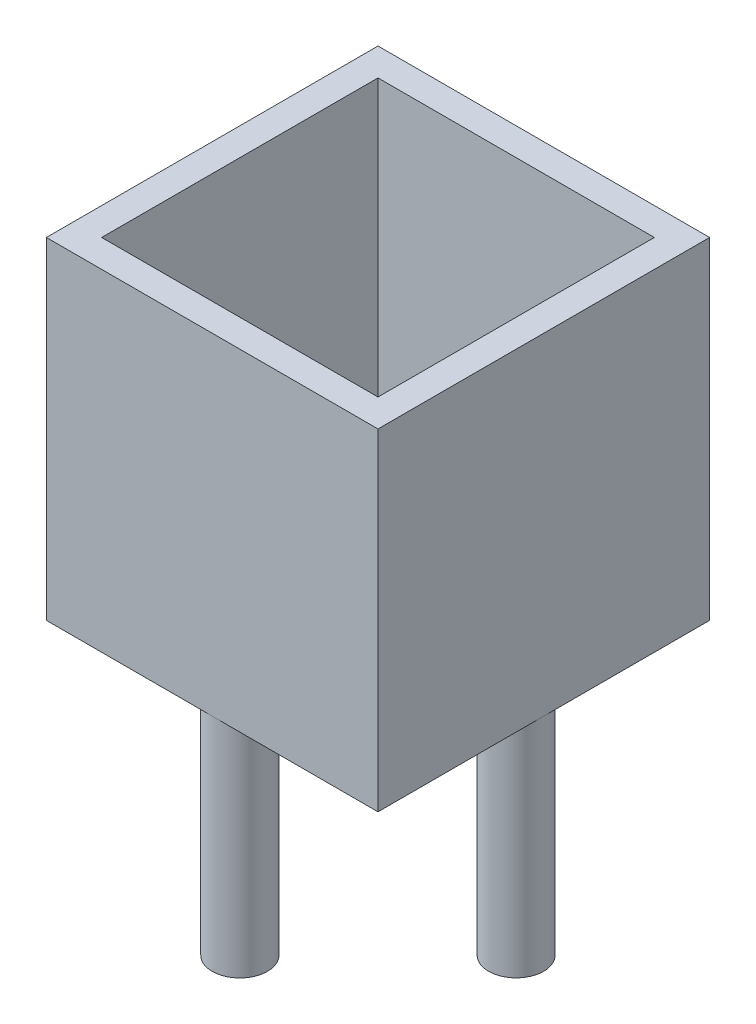
ISO-10303-21;
HEADER;
FILE_DESCRIPTION(('STEP AP214'),'2;1');
FILE_NAME('part.step','',(''),(''),'','','');
FILE_SCHEMA(('AUTOMOTIVE_DESIGN { 1 0 10303 214 1 1 1 1 }'));
ENDSEC;
DATA;
#1=APPLICATION_CONTEXT('core data for automotive mechanical design processes');
#2=APPLICATION_PROTOCOL_DEFINITION('international standard','automotive_design',2000,#1);
#3=PRODUCT_CONTEXT('',#1,'mechanical');
#4=PRODUCT('Part','Part','',(#3));
#5=PRODUCT_RELATED_PRODUCT_CATEGORY('part','',(#4));
#6=PRODUCT_DEFINITION_FORMATION('','',#4);
#7=PRODUCT_DEFINITION_CONTEXT('part definition',#1,'design');
#8=PRODUCT_DEFINITION('design','',#6,#7);
#9=PRODUCT_DEFINITION_SHAPE('','',#8);
#10=(LENGTH_UNIT() NAMED_UNIT(*) SI_UNIT(.MILLI.,.METRE.));
#11=(NAMED_UNIT(*) PLANE_ANGLE_UNIT() SI_UNIT($,.RADIAN.));
#12=(NAMED_UNIT(*) SI_UNIT($,.STERADIAN.) SOLID_ANGLE_UNIT());
#13=UNCERTAINTY_MEASURE_WITH_UNIT(LENGTH_MEASURE(1.E-05),#10,'distance_accuracy_value','');
#14=(GEOMETRIC_REPRESENTATION_CONTEXT(3) GLOBAL_UNCERTAINTY_ASSIGNED_CONTEXT((#13)) GLOBAL_UNIT_ASSIGNED_CONTEXT((#10,
#11,#12)) REPRESENTATION_CONTEXT('',''));
#15=CARTESIAN_POINT('',(0.,0.,0.));
#16=DIRECTION('',(0.,0.,1.));
#17=DIRECTION('',(1.,0.,0.));
#18=AXIS2_PLACEMENT_3D('',#15,#16,#17);
#19=CARTESIAN_POINT('',(-50.,-80.,0.));
#20=DIRECTION('',(0.,1.,0.));
#21=DIRECTION('',(0.,0.,1.));
#22=AXIS2_PLACEMENT_3D('',#19,#20,#21);
#23=CYLINDRICAL_SURFACE('',#22,10.);
#24=CARTESIAN_POINT('',(-50.,0.,0.));
#25=DIRECTION('',(0.,-1.,0.));
#26=DIRECTION('',(0.,0.,-1.));
#27=AXIS2_PLACEMENT_3D('',#24,#25,#26);
#28=CIRCLE('',#27,10.);
#29=CARTESIAN_POINT('',(-50.,0.,-10.));
#30=VERTEX_POINT('',#29);
#31=EDGE_CURVE('E42',#30,#30,#28,.T.);
#32=ORIENTED_EDGE('',*,*,#31,.T.);
#33=EDGE_LOOP('',(#32));
#34=FACE_BOUND('',#33,.T.);
#35=CARTESIAN_POINT('',(-50.,-80.,0.));
#36=DIRECTION('',(0.,-1.,0.));
#37=DIRECTION('',(0.,0.,-1.));
#38=AXIS2_PLACEMENT_3D('',#35,#36,#37);
#39=CIRCLE('',#38,10.);
#40=CARTESIAN_POINT('',(-50.,-80.,-10.));
#41=VERTEX_POINT('',#40);
#42=EDGE_CURVE('E11',#41,#41,#39,.T.);
#43=ORIENTED_EDGE('',*,*,#42,.F.);
#44=EDGE_LOOP('',(#43));
#45=FACE_BOUND('',#44,.T.);
#46=ADVANCED_FACE('F39',(#34,#45),#23,.T.);
#47=CARTESIAN_POINT('',(-50.,-80.,0.));
#48=DIRECTION('',(0.,-1.,0.));
#49=DIRECTION('',(0.,0.,-1.));
#50=AXIS2_PLACEMENT_3D('',#47,#48,#49);
#51=PLANE('',#50);
#52=ORIENTED_EDGE('',*,*,#42,.T.);
#53=EDGE_LOOP('',(#52));
#54=FACE_BOUND('',#53,.T.);
#55=ADVANCED_FACE('F55',(#54),#51,.T.);
#56=CARTESIAN_POINT('',(-50.,0.,0.));
#57=DIRECTION('',(0.,-1.,0.));
#58=DIRECTION('',(0.,0.,-1.));
#59=AXIS2_PLACEMENT_3D('',#56,#57,#58);
#60=PLANE('',#59);
#61=ORIENTED_EDGE('',*,*,#31,.F.);
#62=EDGE_LOOP('',(#61));
#63=FACE_BOUND('',#62,.T.);
#64=ADVANCED_FACE('F53',(#63),#60,.F.);
#65=CLOSED_SHELL('',(#46,#55,#64));
#66=MANIFOLD_SOLID_BREP('B2',#65);
#67=CARTESIAN_POINT('',(0.,-80.,-50.));
#68=DIRECTION('',(0.,1.,0.));
#69=DIRECTION('',(0.,0.,1.));
#70=AXIS2_PLACEMENT_3D('',#67,#68,#69);
#71=CYLINDRICAL_SURFACE('',#70,10.);
#72=CARTESIAN_POINT('',(0.,0.,-50.));
#73=DIRECTION('',(0.,-1.,0.));
#74=DIRECTION('',(0.,0.,-1.));
#75=AXIS2_PLACEMENT_3D('',#72,#73,#74);
#76=CIRCLE('',#75,10.);
#77=CARTESIAN_POINT('',(0.,0.,-60.));
#78=VERTEX_POINT('',#77);
#79=EDGE_CURVE('E86',#78,#78,#76,.T.);
#80=ORIENTED_EDGE('',*,*,#79,.T.);
#81=EDGE_LOOP('',(#80));
#82=FACE_BOUND('',#81,.T.);
#83=CARTESIAN_POINT('',(0.,-80.,-50.));
#84=DIRECTION('',(0.,-1.,0.));
#85=DIRECTION('',(0.,0.,-1.));
#86=AXIS2_PLACEMENT_3D('',#83,#84,#85);
#87=CIRCLE('',#86,10.);
#88=CARTESIAN_POINT('',(0.,-80.,-60.));
#89=VERTEX_POINT('',#88);
#90=EDGE_CURVE('E38',#89,#89,#87,.T.);
#91=ORIENTED_EDGE('',*,*,#90,.F.);
#92=EDGE_LOOP('',(#91));
#93=FACE_BOUND('',#92,.T.);
#94=ADVANCED_FACE('F83',(#82,#93),#71,.T.);
#95=CARTESIAN_POINT('',(0.,-80.,-50.));
#96=DIRECTION('',(0.,-1.,0.));
#97=DIRECTION('',(0.,0.,-1.));
#98=AXIS2_PLACEMENT_3D('',#95,#96,#97);
#99=PLANE('',#98);
#100=ORIENTED_EDGE('',*,*,#90,.T.);
#101=EDGE_LOOP('',(#100));
#102=FACE_BOUND('',#101,.T.);
#103=ADVANCED_FACE('F99',(#102),#99,.T.);
#104=CARTESIAN_POINT('',(0.,0.,-50.));
#105=DIRECTION('',(0.,-1.,0.));
#106=DIRECTION('',(0.,0.,-1.));
#107=AXIS2_PLACEMENT_3D('',#104,#105,#106);
#108=PLANE('',#107);
#109=ORIENTED_EDGE('',*,*,#79,.F.);
#110=EDGE_LOOP('',(#109));
#111=FACE_BOUND('',#110,.T.);
#112=ADVANCED_FACE('F97',(#111),#108,.F.);
#113=CLOSED_SHELL('',(#94,#103,#112));
#114=MANIFOLD_SOLID_BREP('B6',#113);
#115=CARTESIAN_POINT('',(49.9764103791812,-80.,0.));
#116=DIRECTION('',(0.,1.,0.));
#117=DIRECTION('',(0.,0.,1.));
#118=AXIS2_PLACEMENT_3D('',#115,#116,#117);
#119=CYLINDRICAL_SURFACE('',#118,9.97641037918125);
#120=CARTESIAN_POINT('',(49.9764103791812,0.,0.));
#121=DIRECTION('',(0.,-1.,0.));
#122=DIRECTION('',(0.,0.,-1.));
#123=AXIS2_PLACEMENT_3D('',#120,#121,#122);
#124=CIRCLE('',#123,9.97641037918125);
#125=CARTESIAN_POINT('',(49.9764103791812,0.,-9.97641037918125));
#126=VERTEX_POINT('',#125);
#127=EDGE_CURVE('E130',#126,#126,#124,.T.);
#128=ORIENTED_EDGE('',*,*,#127,.T.);
#129=EDGE_LOOP('',(#128));
#130=FACE_BOUND('',#129,.T.);
#131=CARTESIAN_POINT('',(49.9764103791812,-80.,0.));
#132=DIRECTION('',(0.,-1.,0.));
#133=DIRECTION('',(0.,0.,-1.));
#134=AXIS2_PLACEMENT_3D('',#131,#132,#133);
#135=CIRCLE('',#134,9.97641037918125);
#136=CARTESIAN_POINT('',(49.9764103791812,-80.,-9.97641037918125));
#137=VERTEX_POINT('',#136);
#138=EDGE_CURVE('E82',#137,#137,#135,.T.);
#139=ORIENTED_EDGE('',*,*,#138,.F.);
#140=EDGE_LOOP('',(#139));
#141=FACE_BOUND('',#140,.T.);
#142=ADVANCED_FACE('F127',(#130,#141),#119,.T.);
#143=CARTESIAN_POINT('',(49.9764103791812,-80.,0.));
#144=DIRECTION('',(0.,-1.,0.));
#145=DIRECTION('',(0.,0.,-1.));
#146=AXIS2_PLACEMENT_3D('',#143,#144,#145);
#147=PLANE('',#146);
#148=ORIENTED_EDGE('',*,*,#138,.T.);
#149=EDGE_LOOP('',(#148));
#150=FACE_BOUND('',#149,.T.);
#151=ADVANCED_FACE('F143',(#150),#147,.T.);
#152=CARTESIAN_POINT('',(49.9764103791812,0.,0.));
#153=DIRECTION('',(0.,-1.,0.));
#154=DIRECTION('',(0.,0.,-1.));
#155=AXIS2_PLACEMENT_3D('',#152,#153,#154);
#156=PLANE('',#155);
#157=ORIENTED_EDGE('',*,*,#127,.F.);
#158=EDGE_LOOP('',(#157));
#159=FACE_BOUND('',#158,.T.);
#160=ADVANCED_FACE('F141',(#159),#156,.F.);
#161=CLOSED_SHELL('',(#142,#151,#160));
#162=MANIFOLD_SOLID_BREP('B33',#161);
#163=CARTESIAN_POINT('',(0.,-80.,50.));
#164=DIRECTION('',(0.,1.,0.));
#165=DIRECTION('',(0.,0.,1.));
#166=AXIS2_PLACEMENT_3D('',#163,#164,#165);
#167=CYLINDRICAL_SURFACE('',#166,10.);
#168=CARTESIAN_POINT('',(0.,0.,50.));
#169=DIRECTION('',(0.,-1.,0.));
#170=DIRECTION('',(0.,0.,-1.));
#171=AXIS2_PLACEMENT_3D('',#168,#169,#170);
#172=CIRCLE('',#171,10.);
#173=CARTESIAN_POINT('',(0.,0.,40.));
#174=VERTEX_POINT('',#173);
#175=EDGE_CURVE('E175',#174,#174,#172,.T.);
#176=ORIENTED_EDGE('',*,*,#175,.T.);
#177=EDGE_LOOP('',(#176));
#178=FACE_BOUND('',#177,.T.);
#179=CARTESIAN_POINT('',(0.,-80.,50.));
#180=DIRECTION('',(0.,-1.,0.));
#181=DIRECTION('',(0.,0.,-1.));
#182=AXIS2_PLACEMENT_3D('',#179,#180,#181);
#183=CIRCLE('',#182,10.);
#184=CARTESIAN_POINT('',(0.,-80.,40.));
#185=VERTEX_POINT('',#184);
#186=EDGE_CURVE('E126',#185,#185,#183,.T.);
#187=ORIENTED_EDGE('',*,*,#186,.F.);
#188=EDGE_LOOP('',(#187));
#189=FACE_BOUND('',#188,.T.);
#190=ADVANCED_FACE('F172',(#178,#189),#167,.T.);
#191=CARTESIAN_POINT('',(0.,-80.,50.));
#192=DIRECTION('',(0.,-1.,0.));
#193=DIRECTION('',(0.,0.,-1.));
#194=AXIS2_PLACEMENT_3D('',#191,#192,#193);
#195=PLANE('',#194);
#196=ORIENTED_EDGE('',*,*,#186,.T.);
#197=EDGE_LOOP('',(#196));
#198=FACE_BOUND('',#197,.T.);
#199=ADVANCED_FACE('F188',(#198),#195,.T.);
#200=CARTESIAN_POINT('',(0.,0.,50.));
#201=DIRECTION('',(0.,-1.,0.));
#202=DIRECTION('',(0.,0.,-1.));
#203=AXIS2_PLACEMENT_3D('',#200,#201,#202);
#204=PLANE('',#203);
#205=ORIENTED_EDGE('',*,*,#175,.F.);
#206=EDGE_LOOP('',(#205));
#207=FACE_BOUND('',#206,.T.);
#208=ADVANCED_FACE('F186',(#207),#204,.F.);
#209=CLOSED_SHELL('',(#190,#199,#208));
#210=MANIFOLD_SOLID_BREP('B77',#209);
#211=CARTESIAN_POINT('',(0.,0.,0.));
#212=DIRECTION('',(0.,-1.,0.));
#213=DIRECTION('',(0.,0.,-1.));
#214=AXIS2_PLACEMENT_3D('',#211,#212,#213);
#215=PLANE('',#214);
#216=DIRECTION('',(0.,0.,-1.));
#217=VECTOR('',#216,1.);
#218=CARTESIAN_POINT('',(60.,0.,60.));
#219=LINE('',#218,#217);
#220=CARTESIAN_POINT('',(60.,0.,60.));
#221=VERTEX_POINT('',#220);
#222=CARTESIAN_POINT('',(60.,0.,-60.));
#223=VERTEX_POINT('',#222);
#224=EDGE_CURVE('E306',#221,#223,#219,.T.);
#225=ORIENTED_EDGE('',*,*,#224,.F.);
#226=DIRECTION('',(1.,0.,0.));
#227=VECTOR('',#226,1.);
#228=CARTESIAN_POINT('',(-60.,0.,60.));
#229=LINE('',#228,#227);
#230=CARTESIAN_POINT('',(-60.,0.,60.));
#231=VERTEX_POINT('',#230);
#232=EDGE_CURVE('E311',#231,#221,#229,.T.);
#233=ORIENTED_EDGE('',*,*,#232,.F.);
#234=DIRECTION('',(0.,0.,1.));
#235=VECTOR('',#234,1.);
#236=CARTESIAN_POINT('',(-60.,0.,60.));
#237=LINE('',#236,#235);
#238=CARTESIAN_POINT('',(-60.,0.,-60.));
#239=VERTEX_POINT('',#238);
#240=EDGE_CURVE('E323',#239,#231,#237,.T.);
#241=ORIENTED_EDGE('',*,*,#240,.F.);
#242=DIRECTION('',(-1.,0.,0.));
#243=VECTOR('',#242,1.);
#244=CARTESIAN_POINT('',(-60.,0.,-60.));
#245=LINE('',#244,#243);
#246=EDGE_CURVE('E320',#223,#239,#245,.T.);
#247=ORIENTED_EDGE('',*,*,#246,.F.);
#248=EDGE_LOOP('',(#225,#233,#241,#247));
#249=FACE_BOUND('',#248,.T.);
#250=ADVANCED_FACE('F208',(#249),#215,.T.);
#251=CARTESIAN_POINT('',(0.,120.,0.));
#252=DIRECTION('',(0.,-1.,0.));
#253=DIRECTION('',(0.,0.,-1.));
#254=AXIS2_PLACEMENT_3D('',#251,#252,#253);
#255=PLANE('',#254);
#256=DIRECTION('',(0.,0.,-1.));
#257=VECTOR('',#256,1.);
#258=CARTESIAN_POINT('',(60.,120.,60.));
#259=LINE('',#258,#257);
#260=CARTESIAN_POINT('',(60.,120.,60.));
#261=VERTEX_POINT('',#260);
#262=CARTESIAN_POINT('',(60.,120.,-60.));
#263=VERTEX_POINT('',#262);
#264=EDGE_CURVE('E307',#261,#263,#259,.T.);
#265=ORIENTED_EDGE('',*,*,#264,.T.);
#266=DIRECTION('',(-1.,0.,0.));
#267=VECTOR('',#266,1.);
#268=CARTESIAN_POINT('',(-60.,120.,-60.));
#269=LINE('',#268,#267);
#270=CARTESIAN_POINT('',(-60.,120.,-60.));
#271=VERTEX_POINT('',#270);
#272=EDGE_CURVE('E310',#263,#271,#269,.T.);
#273=ORIENTED_EDGE('',*,*,#272,.T.);
#274=DIRECTION('',(0.,0.,1.));
#275=VECTOR('',#274,1.);
#276=CARTESIAN_POINT('',(-60.,120.,60.));
#277=LINE('',#276,#275);
#278=CARTESIAN_POINT('',(-60.,120.,60.));
#279=VERTEX_POINT('',#278);
#280=EDGE_CURVE('E313',#271,#279,#277,.T.);
#281=ORIENTED_EDGE('',*,*,#280,.T.);
#282=DIRECTION('',(1.,0.,0.));
#283=VECTOR('',#282,1.);
#284=CARTESIAN_POINT('',(-60.,120.,60.));
#285=LINE('',#284,#283);
#286=EDGE_CURVE('E315',#279,#261,#285,.T.);
#287=ORIENTED_EDGE('',*,*,#286,.T.);
#288=EDGE_LOOP('',(#265,#273,#281,#287));
#289=FACE_BOUND('',#288,.T.);
#290=DIRECTION('',(0.,0.,-1.));
#291=VECTOR('',#290,1.);
#292=CARTESIAN_POINT('',(50.,120.,50.));
#293=LINE('',#292,#291);
#294=CARTESIAN_POINT('',(50.,120.,50.));
#295=VERTEX_POINT('',#294);
#296=CARTESIAN_POINT('',(50.,120.,-50.));
#297=VERTEX_POINT('',#296);
#298=EDGE_CURVE('E289',#295,#297,#293,.T.);
#299=ORIENTED_EDGE('',*,*,#298,.F.);
#300=DIRECTION('',(1.,0.,0.));
#301=VECTOR('',#300,1.);
#302=CARTESIAN_POINT('',(-50.,120.,50.));
#303=LINE('',#302,#301);
#304=CARTESIAN_POINT('',(-50.,120.,50.));
#305=VERTEX_POINT('',#304);
#306=EDGE_CURVE('E279',#305,#295,#303,.T.);
#307=ORIENTED_EDGE('',*,*,#306,.F.);
#308=DIRECTION('',(0.,0.,1.));
#309=VECTOR('',#308,1.);
#310=CARTESIAN_POINT('',(-50.,120.,50.));
#311=LINE('',#310,#309);
#312=CARTESIAN_POINT('',(-50.,120.,-50.));
#313=VERTEX_POINT('',#312);
#314=EDGE_CURVE('E298',#313,#305,#311,.T.);
#315=ORIENTED_EDGE('',*,*,#314,.F.);
#316=DIRECTION('',(-1.,0.,0.));
#317=VECTOR('',#316,1.);
#318=CARTESIAN_POINT('',(-50.,120.,-50.));
#319=LINE('',#318,#317);
#320=EDGE_CURVE('E296',#297,#313,#319,.T.);
#321=ORIENTED_EDGE('',*,*,#320,.F.);
#322=EDGE_LOOP('',(#299,#307,#315,#321));
#323=FACE_BOUND('',#322,.T.);
#324=ADVANCED_FACE('F352',(#289,#323),#255,.F.);
#325=CARTESIAN_POINT('',(60.,120.,60.));
#326=DIRECTION('',(-1.,0.,0.));
#327=DIRECTION('',(0.,0.,1.));
#328=AXIS2_PLACEMENT_3D('',#325,#326,#327);
#329=PLANE('',#328);
#330=DIRECTION('',(0.,-1.,0.));
#331=VECTOR('',#330,1.);
#332=CARTESIAN_POINT('',(60.,120.,60.));
#333=LINE('',#332,#331);
#334=EDGE_CURVE('E317',#261,#221,#333,.T.);
#335=ORIENTED_EDGE('',*,*,#334,.T.);
#336=ORIENTED_EDGE('',*,*,#224,.T.);
#337=DIRECTION('',(0.,-1.,0.));
#338=VECTOR('',#337,1.);
#339=CARTESIAN_POINT('',(60.,120.,-60.));
#340=LINE('',#339,#338);
#341=EDGE_CURVE('E216',#263,#223,#340,.T.);
#342=ORIENTED_EDGE('',*,*,#341,.F.);
#343=ORIENTED_EDGE('',*,*,#264,.F.);
#344=EDGE_LOOP('',(#335,#336,#342,#343));
#345=FACE_BOUND('',#344,.T.);
#346=ADVANCED_FACE('F210',(#345),#329,.F.);
#347=CARTESIAN_POINT('',(-60.,120.,-60.));
#348=DIRECTION('',(0.,0.,1.));
#349=DIRECTION('',(1.,0.,0.));
#350=AXIS2_PLACEMENT_3D('',#347,#348,#349);
#351=PLANE('',#350);
#352=ORIENTED_EDGE('',*,*,#341,.T.);
#353=ORIENTED_EDGE('',*,*,#246,.T.);
#354=DIRECTION('',(0.,-1.,0.));
#355=VECTOR('',#354,1.);
#356=CARTESIAN_POINT('',(-60.,120.,-60.));
#357=LINE('',#356,#355);
#358=EDGE_CURVE('E331',#271,#239,#357,.T.);
#359=ORIENTED_EDGE('',*,*,#358,.F.);
#360=ORIENTED_EDGE('',*,*,#272,.F.);
#361=EDGE_LOOP('',(#352,#353,#359,#360));
#362=FACE_BOUND('',#361,.T.);
#363=ADVANCED_FACE('F335',(#362),#351,.F.);
#364=CARTESIAN_POINT('',(-60.,120.,60.));
#365=DIRECTION('',(1.,0.,0.));
#366=DIRECTION('',(0.,0.,-1.));
#367=AXIS2_PLACEMENT_3D('',#364,#365,#366);
#368=PLANE('',#367);
#369=ORIENTED_EDGE('',*,*,#358,.T.);
#370=ORIENTED_EDGE('',*,*,#240,.T.);
#371=DIRECTION('',(0.,-1.,0.));
#372=VECTOR('',#371,1.);
#373=CARTESIAN_POINT('',(-60.,120.,60.));
#374=LINE('',#373,#372);
#375=EDGE_CURVE('E329',#279,#231,#374,.T.);
#376=ORIENTED_EDGE('',*,*,#375,.F.);
#377=ORIENTED_EDGE('',*,*,#280,.F.);
#378=EDGE_LOOP('',(#369,#370,#376,#377));
#379=FACE_BOUND('',#378,.T.);
#380=ADVANCED_FACE('F350',(#379),#368,.F.);
#381=CARTESIAN_POINT('',(-60.,120.,60.));
#382=DIRECTION('',(0.,0.,-1.));
#383=DIRECTION('',(-1.,0.,0.));
#384=AXIS2_PLACEMENT_3D('',#381,#382,#383);
#385=PLANE('',#384);
#386=ORIENTED_EDGE('',*,*,#375,.T.);
#387=ORIENTED_EDGE('',*,*,#232,.T.);
#388=ORIENTED_EDGE('',*,*,#334,.F.);
#389=ORIENTED_EDGE('',*,*,#286,.F.);
#390=EDGE_LOOP('',(#386,#387,#388,#389));
#391=FACE_BOUND('',#390,.T.);
#392=ADVANCED_FACE('F346',(#391),#385,.F.);
#393=CARTESIAN_POINT('',(50.,120.,50.));
#394=DIRECTION('',(-1.,0.,0.));
#395=DIRECTION('',(0.,0.,1.));
#396=AXIS2_PLACEMENT_3D('',#393,#394,#395);
#397=PLANE('',#396);
#398=DIRECTION('',(0.,0.,-1.));
#399=VECTOR('',#398,1.);
#400=CARTESIAN_POINT('',(50.,9.99999999999999,50.));
#401=LINE('',#400,#399);
#402=CARTESIAN_POINT('',(50.,9.99999999999999,50.));
#403=VERTEX_POINT('',#402);
#404=CARTESIAN_POINT('',(50.,9.99999999999999,-50.));
#405=VERTEX_POINT('',#404);
#406=EDGE_CURVE('E285',#403,#405,#401,.T.);
#407=ORIENTED_EDGE('',*,*,#406,.F.);
#408=DIRECTION('',(0.,-1.,0.));
#409=VECTOR('',#408,1.);
#410=CARTESIAN_POINT('',(50.,120.,50.));
#411=LINE('',#410,#409);
#412=EDGE_CURVE('E275',#295,#403,#411,.T.);
#413=ORIENTED_EDGE('',*,*,#412,.F.);
#414=ORIENTED_EDGE('',*,*,#298,.T.);
#415=DIRECTION('',(0.,-1.,0.));
#416=VECTOR('',#415,1.);
#417=CARTESIAN_POINT('',(50.,120.,-50.));
#418=LINE('',#417,#416);
#419=EDGE_CURVE('E287',#297,#405,#418,.T.);
#420=ORIENTED_EDGE('',*,*,#419,.T.);
#421=EDGE_LOOP('',(#407,#413,#414,#420));
#422=FACE_BOUND('',#421,.T.);
#423=ADVANCED_FACE('F286',(#422),#397,.T.);
#424=CARTESIAN_POINT('',(-50.,120.,-50.));
#425=DIRECTION('',(0.,0.,1.));
#426=DIRECTION('',(1.,0.,0.));
#427=AXIS2_PLACEMENT_3D('',#424,#425,#426);
#428=PLANE('',#427);
#429=DIRECTION('',(-1.,0.,0.));
#430=VECTOR('',#429,1.);
#431=CARTESIAN_POINT('',(-50.,9.99999999999999,-50.));
#432=LINE('',#431,#430);
#433=CARTESIAN_POINT('',(-50.,9.99999999999999,-50.));
#434=VERTEX_POINT('',#433);
#435=EDGE_CURVE('E223',#405,#434,#432,.T.);
#436=ORIENTED_EDGE('',*,*,#435,.F.);
#437=ORIENTED_EDGE('',*,*,#419,.F.);
#438=ORIENTED_EDGE('',*,*,#320,.T.);
#439=DIRECTION('',(0.,-1.,0.));
#440=VECTOR('',#439,1.);
#441=CARTESIAN_POINT('',(-50.,120.,-50.));
#442=LINE('',#441,#440);
#443=EDGE_CURVE('E303',#313,#434,#442,.T.);
#444=ORIENTED_EDGE('',*,*,#443,.T.);
#445=EDGE_LOOP('',(#436,#437,#438,#444));
#446=FACE_BOUND('',#445,.T.);
#447=ADVANCED_FACE('F358',(#446),#428,.T.);
#448=CARTESIAN_POINT('',(-50.,120.,50.));
#449=DIRECTION('',(1.,0.,0.));
#450=DIRECTION('',(0.,0.,-1.));
#451=AXIS2_PLACEMENT_3D('',#448,#449,#450);
#452=PLANE('',#451);
#453=DIRECTION('',(0.,0.,1.));
#454=VECTOR('',#453,1.);
#455=CARTESIAN_POINT('',(-50.,9.99999999999999,50.));
#456=LINE('',#455,#454);
#457=CARTESIAN_POINT('',(-50.,9.99999999999999,50.));
#458=VERTEX_POINT('',#457);
#459=EDGE_CURVE('E231',#434,#458,#456,.T.);
#460=ORIENTED_EDGE('',*,*,#459,.F.);
#461=ORIENTED_EDGE('',*,*,#443,.F.);
#462=ORIENTED_EDGE('',*,*,#314,.T.);
#463=DIRECTION('',(0.,-1.,0.));
#464=VECTOR('',#463,1.);
#465=CARTESIAN_POINT('',(-50.,120.,50.));
#466=LINE('',#465,#464);
#467=EDGE_CURVE('E282',#305,#458,#466,.T.);
#468=ORIENTED_EDGE('',*,*,#467,.T.);
#469=EDGE_LOOP('',(#460,#461,#462,#468));
#470=FACE_BOUND('',#469,.T.);
#471=ADVANCED_FACE('F359',(#470),#452,.T.);
#472=CARTESIAN_POINT('',(-50.,120.,50.));
#473=DIRECTION('',(0.,0.,-1.));
#474=DIRECTION('',(-1.,0.,0.));
#475=AXIS2_PLACEMENT_3D('',#472,#473,#474);
#476=PLANE('',#475);
#477=DIRECTION('',(1.,0.,0.));
#478=VECTOR('',#477,1.);
#479=CARTESIAN_POINT('',(-50.,9.99999999999999,50.));
#480=LINE('',#479,#478);
#481=EDGE_CURVE('E170',#458,#403,#480,.T.);
#482=ORIENTED_EDGE('',*,*,#481,.F.);
#483=ORIENTED_EDGE('',*,*,#467,.F.);
#484=ORIENTED_EDGE('',*,*,#306,.T.);
#485=ORIENTED_EDGE('',*,*,#412,.T.);
#486=EDGE_LOOP('',(#482,#483,#484,#485));
#487=FACE_BOUND('',#486,.T.);
#488=ADVANCED_FACE('F277',(#487),#476,.T.);
#489=CARTESIAN_POINT('',(0.,10.,0.));
#490=DIRECTION('',(0.,1.,0.));
#491=DIRECTION('',(0.,0.,1.));
#492=AXIS2_PLACEMENT_3D('',#489,#490,#491);
#493=PLANE('',#492);
#494=ORIENTED_EDGE('',*,*,#481,.T.);
#495=ORIENTED_EDGE('',*,*,#406,.T.);
#496=ORIENTED_EDGE('',*,*,#435,.T.);
#497=ORIENTED_EDGE('',*,*,#459,.T.);
#498=EDGE_LOOP('',(#494,#495,#496,#497));
#499=FACE_BOUND('',#498,.T.);
#500=ADVANCED_FACE('F291',(#499),#493,.T.);
#501=CLOSED_SHELL('',(#250,#324,#346,#363,#380,#392,#423,#447,#471,#488,#500));
#502=MANIFOLD_SOLID_BREP('B121',#501);
#503=ADVANCED_BREP_SHAPE_REPRESENTATION('',(#18,#66,#114,#162,#210,#502),#14);
#504=SHAPE_DEFINITION_REPRESENTATION(#9,#503);
ENDSEC;
END-ISO-10303-21;
